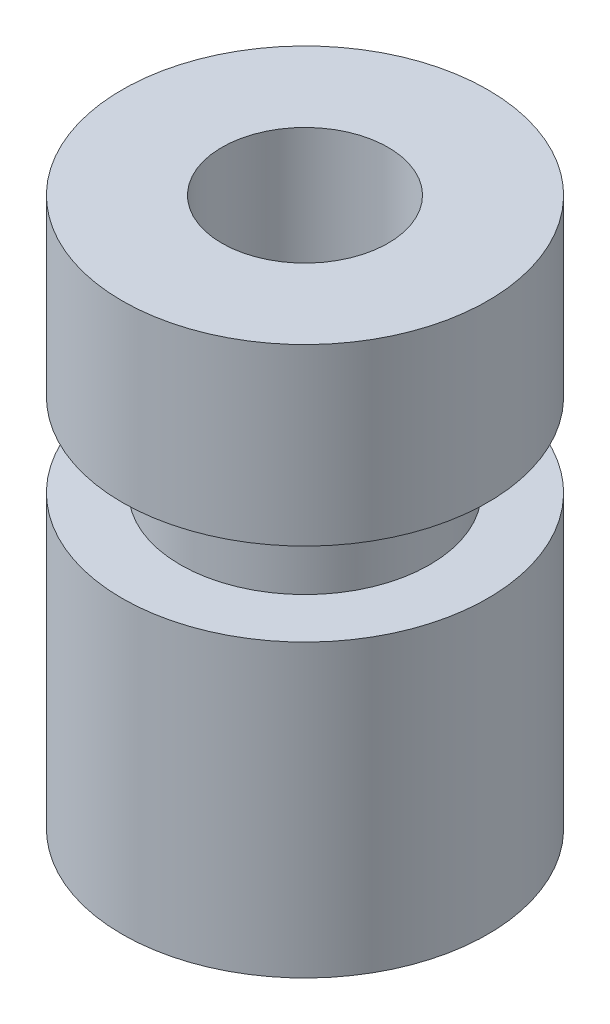
ISO-10303-21;
HEADER;
FILE_DESCRIPTION(('STEP AP214'),'2;1');
FILE_NAME('part.step','',(''),(''),'','','');
FILE_SCHEMA(('AUTOMOTIVE_DESIGN { 1 0 10303 214 1 1 1 1 }'));
ENDSEC;
DATA;
#1=APPLICATION_CONTEXT('core data for automotive mechanical design processes');
#2=APPLICATION_PROTOCOL_DEFINITION('international standard','automotive_design',2000,#1);
#3=PRODUCT_CONTEXT('',#1,'mechanical');
#4=PRODUCT('Part','Part','',(#3));
#5=PRODUCT_RELATED_PRODUCT_CATEGORY('part','',(#4));
#6=PRODUCT_DEFINITION_FORMATION('','',#4);
#7=PRODUCT_DEFINITION_CONTEXT('part definition',#1,'design');
#8=PRODUCT_DEFINITION('design','',#6,#7);
#9=PRODUCT_DEFINITION_SHAPE('','',#8);
#10=(LENGTH_UNIT() NAMED_UNIT(*) SI_UNIT(.MILLI.,.METRE.));
#11=(NAMED_UNIT(*) PLANE_ANGLE_UNIT() SI_UNIT($,.RADIAN.));
#12=(NAMED_UNIT(*) SI_UNIT($,.STERADIAN.) SOLID_ANGLE_UNIT());
#13=UNCERTAINTY_MEASURE_WITH_UNIT(LENGTH_MEASURE(1.E-05),#10,'distance_accuracy_value','');
#14=(GEOMETRIC_REPRESENTATION_CONTEXT(3) GLOBAL_UNCERTAINTY_ASSIGNED_CONTEXT((#13)) GLOBAL_UNIT_ASSIGNED_CONTEXT((#10,
#11,#12)) REPRESENTATION_CONTEXT('',''));
#15=CARTESIAN_POINT('',(0.,0.,0.));
#16=DIRECTION('',(0.,0.,1.));
#17=DIRECTION('',(1.,0.,0.));
#18=AXIS2_PLACEMENT_3D('',#15,#16,#17);
#19=CARTESIAN_POINT('',(0.999999999999999,6.6,0.));
#20=DIRECTION('',(0.,-1.,0.));
#21=DIRECTION('',(0.,0.,-1.));
#22=AXIS2_PLACEMENT_3D('',#19,#20,#21);
#23=PLANE('',#22);
#24=CARTESIAN_POINT('',(0.,6.6,0.));
#25=DIRECTION('',(0.,1.,0.));
#26=DIRECTION('',(0.,0.,1.));
#27=AXIS2_PLACEMENT_3D('',#24,#25,#26);
#28=CIRCLE('',#27,0.999999999999999);
#29=CARTESIAN_POINT('',(0.,6.6,0.999999999999999));
#30=VERTEX_POINT('',#29);
#31=EDGE_CURVE('E78',#30,#30,#28,.T.);
#32=ORIENTED_EDGE('',*,*,#31,.F.);
#33=EDGE_LOOP('',(#32));
#34=FACE_BOUND('',#33,.T.);
#35=CARTESIAN_POINT('',(0.,6.6,0.));
#36=DIRECTION('',(0.,1.,0.));
#37=DIRECTION('',(0.,0.,1.));
#38=AXIS2_PLACEMENT_3D('',#35,#36,#37);
#39=CIRCLE('',#38,2.2);
#40=CARTESIAN_POINT('',(0.,6.6,2.2));
#41=VERTEX_POINT('',#40);
#42=EDGE_CURVE('E10',#41,#41,#39,.T.);
#43=ORIENTED_EDGE('',*,*,#42,.T.);
#44=EDGE_LOOP('',(#43));
#45=FACE_BOUND('',#44,.T.);
#46=ADVANCED_FACE('F43',(#34,#45),#23,.F.);
#47=CARTESIAN_POINT('',(0.,1.74528301886792,0.));
#48=DIRECTION('',(0.,1.,0.));
#49=DIRECTION('',(0.,0.,1.));
#50=AXIS2_PLACEMENT_3D('',#47,#48,#49);
#51=CYLINDRICAL_SURFACE('',#50,2.2);
#52=ORIENTED_EDGE('',*,*,#42,.F.);
#53=EDGE_LOOP('',(#52));
#54=FACE_BOUND('',#53,.T.);
#55=CARTESIAN_POINT('',(0.,4.5,0.));
#56=DIRECTION('',(0.,1.,0.));
#57=DIRECTION('',(0.,0.,1.));
#58=AXIS2_PLACEMENT_3D('',#55,#56,#57);
#59=CIRCLE('',#58,2.2);
#60=CARTESIAN_POINT('',(0.,4.5,2.2));
#61=VERTEX_POINT('',#60);
#62=EDGE_CURVE('E50',#61,#61,#59,.T.);
#63=ORIENTED_EDGE('',*,*,#62,.T.);
#64=EDGE_LOOP('',(#63));
#65=FACE_BOUND('',#64,.T.);
#66=ADVANCED_FACE('F86',(#54,#65),#51,.T.);
#67=CARTESIAN_POINT('',(2.2,4.5,0.));
#68=DIRECTION('',(0.,1.,0.));
#69=DIRECTION('',(0.,0.,1.));
#70=AXIS2_PLACEMENT_3D('',#67,#68,#69);
#71=PLANE('',#70);
#72=ORIENTED_EDGE('',*,*,#62,.F.);
#73=EDGE_LOOP('',(#72));
#74=FACE_BOUND('',#73,.T.);
#75=CARTESIAN_POINT('',(0.,4.5,0.));
#76=DIRECTION('',(0.,1.,0.));
#77=DIRECTION('',(0.,0.,1.));
#78=AXIS2_PLACEMENT_3D('',#75,#76,#77);
#79=CIRCLE('',#78,1.5);
#80=CARTESIAN_POINT('',(0.,4.5,1.5));
#81=VERTEX_POINT('',#80);
#82=EDGE_CURVE('E55',#81,#81,#79,.T.);
#83=ORIENTED_EDGE('',*,*,#82,.T.);
#84=EDGE_LOOP('',(#83));
#85=FACE_BOUND('',#84,.T.);
#86=ADVANCED_FACE('F90',(#74,#85),#71,.F.);
#87=CARTESIAN_POINT('',(0.,1.74528301886792,0.));
#88=DIRECTION('',(0.,1.,0.));
#89=DIRECTION('',(0.,0.,1.));
#90=AXIS2_PLACEMENT_3D('',#87,#88,#89);
#91=CYLINDRICAL_SURFACE('',#90,1.5);
#92=ORIENTED_EDGE('',*,*,#82,.F.);
#93=EDGE_LOOP('',(#92));
#94=FACE_BOUND('',#93,.T.);
#95=CARTESIAN_POINT('',(0.,3.5,0.));
#96=DIRECTION('',(0.,1.,0.));
#97=DIRECTION('',(0.,0.,1.));
#98=AXIS2_PLACEMENT_3D('',#95,#96,#97);
#99=CIRCLE('',#98,1.5);
#100=CARTESIAN_POINT('',(0.,3.5,1.5));
#101=VERTEX_POINT('',#100);
#102=EDGE_CURVE('E60',#101,#101,#99,.T.);
#103=ORIENTED_EDGE('',*,*,#102,.T.);
#104=EDGE_LOOP('',(#103));
#105=FACE_BOUND('',#104,.T.);
#106=ADVANCED_FACE('F95',(#94,#105),#91,.T.);
#107=CARTESIAN_POINT('',(1.5,3.5,0.));
#108=DIRECTION('',(0.,-1.,0.));
#109=DIRECTION('',(0.,0.,-1.));
#110=AXIS2_PLACEMENT_3D('',#107,#108,#109);
#111=PLANE('',#110);
#112=ORIENTED_EDGE('',*,*,#102,.F.);
#113=EDGE_LOOP('',(#112));
#114=FACE_BOUND('',#113,.T.);
#115=CARTESIAN_POINT('',(0.,3.5,0.));
#116=DIRECTION('',(0.,1.,0.));
#117=DIRECTION('',(0.,0.,1.));
#118=AXIS2_PLACEMENT_3D('',#115,#116,#117);
#119=CIRCLE('',#118,2.2);
#120=CARTESIAN_POINT('',(0.,3.5,2.2));
#121=VERTEX_POINT('',#120);
#122=EDGE_CURVE('E66',#121,#121,#119,.T.);
#123=ORIENTED_EDGE('',*,*,#122,.T.);
#124=EDGE_LOOP('',(#123));
#125=FACE_BOUND('',#124,.T.);
#126=ADVANCED_FACE('F101',(#114,#125),#111,.F.);
#127=CARTESIAN_POINT('',(0.,1.74528301886792,0.));
#128=DIRECTION('',(0.,1.,0.));
#129=DIRECTION('',(0.,0.,1.));
#130=AXIS2_PLACEMENT_3D('',#127,#128,#129);
#131=CYLINDRICAL_SURFACE('',#130,2.2);
#132=ORIENTED_EDGE('',*,*,#122,.F.);
#133=EDGE_LOOP('',(#132));
#134=FACE_BOUND('',#133,.T.);
#135=CARTESIAN_POINT('',(0.,0.,0.));
#136=DIRECTION('',(0.,1.,0.));
#137=DIRECTION('',(0.,0.,1.));
#138=AXIS2_PLACEMENT_3D('',#135,#136,#137);
#139=CIRCLE('',#138,2.2);
#140=CARTESIAN_POINT('',(0.,0.,2.2));
#141=VERTEX_POINT('',#140);
#142=EDGE_CURVE('E70',#141,#141,#139,.T.);
#143=ORIENTED_EDGE('',*,*,#142,.T.);
#144=EDGE_LOOP('',(#143));
#145=FACE_BOUND('',#144,.T.);
#146=ADVANCED_FACE('F105',(#134,#145),#131,.T.);
#147=CARTESIAN_POINT('',(2.2,0.,0.));
#148=DIRECTION('',(0.,1.,0.));
#149=DIRECTION('',(0.,0.,1.));
#150=AXIS2_PLACEMENT_3D('',#147,#148,#149);
#151=PLANE('',#150);
#152=ORIENTED_EDGE('',*,*,#142,.F.);
#153=EDGE_LOOP('',(#152));
#154=FACE_BOUND('',#153,.T.);
#155=CARTESIAN_POINT('',(0.,0.,0.));
#156=DIRECTION('',(0.,1.,0.));
#157=DIRECTION('',(0.,0.,1.));
#158=AXIS2_PLACEMENT_3D('',#155,#156,#157);
#159=CIRCLE('',#158,1.);
#160=CARTESIAN_POINT('',(0.,0.,1.));
#161=VERTEX_POINT('',#160);
#162=EDGE_CURVE('E74',#161,#161,#159,.T.);
#163=ORIENTED_EDGE('',*,*,#162,.T.);
#164=EDGE_LOOP('',(#163));
#165=FACE_BOUND('',#164,.T.);
#166=ADVANCED_FACE('F109',(#154,#165),#151,.F.);
#167=CARTESIAN_POINT('',(0.,1.74528301886792,0.));
#168=DIRECTION('',(0.,1.,0.));
#169=DIRECTION('',(0.,0.,1.));
#170=AXIS2_PLACEMENT_3D('',#167,#168,#169);
#171=CYLINDRICAL_SURFACE('',#170,1.);
#172=ORIENTED_EDGE('',*,*,#162,.F.);
#173=EDGE_LOOP('',(#172));
#174=FACE_BOUND('',#173,.T.);
#175=ORIENTED_EDGE('',*,*,#31,.T.);
#176=EDGE_LOOP('',(#175));
#177=FACE_BOUND('',#176,.T.);
#178=ADVANCED_FACE('F83',(#174,#177),#171,.F.);
#179=CLOSED_SHELL('',(#46,#66,#86,#106,#126,#146,#166,#178));
#180=MANIFOLD_SOLID_BREP('B2',#179);
#181=ADVANCED_BREP_SHAPE_REPRESENTATION('',(#18,#180),#14);
#182=SHAPE_DEFINITION_REPRESENTATION(#9,#181);
ENDSEC;
END-ISO-10303-21;
